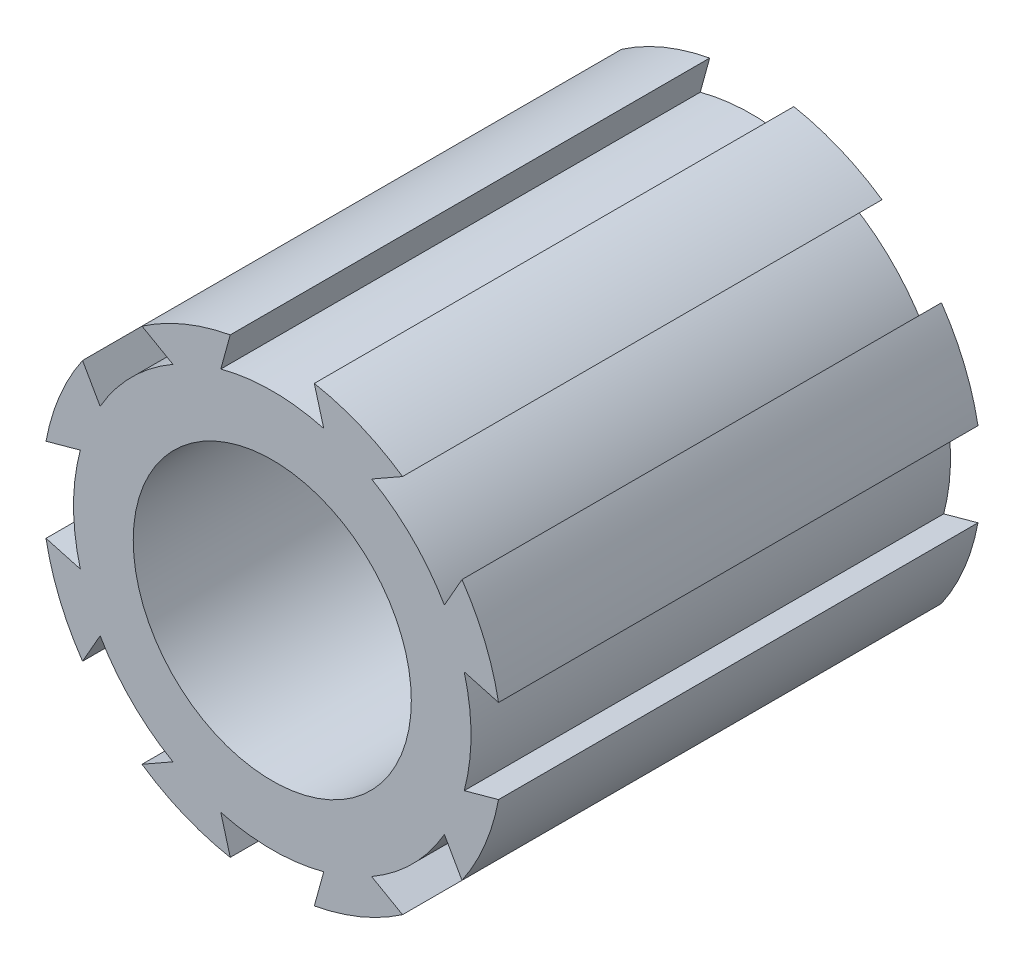
ISO-10303-21;
HEADER;
FILE_DESCRIPTION(('STEP AP214'),'2;1');
FILE_NAME('part.step','',(''),(''),'','','');
FILE_SCHEMA(('AUTOMOTIVE_DESIGN { 1 0 10303 214 1 1 1 1 }'));
ENDSEC;
DATA;
#1=APPLICATION_CONTEXT('core data for automotive mechanical design processes');
#2=APPLICATION_PROTOCOL_DEFINITION('international standard','automotive_design',2000,#1);
#3=PRODUCT_CONTEXT('',#1,'mechanical');
#4=PRODUCT('Part','Part','',(#3));
#5=PRODUCT_RELATED_PRODUCT_CATEGORY('part','',(#4));
#6=PRODUCT_DEFINITION_FORMATION('','',#4);
#7=PRODUCT_DEFINITION_CONTEXT('part definition',#1,'design');
#8=PRODUCT_DEFINITION('design','',#6,#7);
#9=PRODUCT_DEFINITION_SHAPE('','',#8);
#10=(LENGTH_UNIT() NAMED_UNIT(*) SI_UNIT(.MILLI.,.METRE.));
#11=(NAMED_UNIT(*) PLANE_ANGLE_UNIT() SI_UNIT($,.RADIAN.));
#12=(NAMED_UNIT(*) SI_UNIT($,.STERADIAN.) SOLID_ANGLE_UNIT());
#13=UNCERTAINTY_MEASURE_WITH_UNIT(LENGTH_MEASURE(1.E-05),#10,'distance_accuracy_value','');
#14=(GEOMETRIC_REPRESENTATION_CONTEXT(3) GLOBAL_UNCERTAINTY_ASSIGNED_CONTEXT((#13)) GLOBAL_UNIT_ASSIGNED_CONTEXT((#10,
#11,#12)) REPRESENTATION_CONTEXT('',''));
#15=CARTESIAN_POINT('',(0.,0.,0.));
#16=DIRECTION('',(0.,0.,1.));
#17=DIRECTION('',(1.,0.,0.));
#18=AXIS2_PLACEMENT_3D('',#15,#16,#17);
#19=CARTESIAN_POINT('',(0.,0.,50.));
#20=DIRECTION('',(0.,0.,1.));
#21=DIRECTION('',(1.,0.,0.));
#22=AXIS2_PLACEMENT_3D('',#19,#20,#21);
#23=PLANE('',#22);
#24=CARTESIAN_POINT('',(0.,0.,50.));
#25=DIRECTION('',(0.,0.,1.));
#26=DIRECTION('',(1.,0.,0.));
#27=AXIS2_PLACEMENT_3D('',#24,#25,#26);
#28=CIRCLE('',#27,14.5);
#29=CARTESIAN_POINT('',(14.5,0.,50.));
#30=VERTEX_POINT('',#29);
#31=EDGE_CURVE('E400',#30,#30,#28,.T.);
#32=ORIENTED_EDGE('',*,*,#31,.F.);
#33=EDGE_LOOP('',(#32));
#34=FACE_BOUND('',#33,.T.);
#35=DIRECTION('',(0.964233373796851,-0.265054712948747,0.));
#36=VECTOR('',#35,1.);
#37=CARTESIAN_POINT('',(-23.5961797931999,-4.38409616306333,50.));
#38=LINE('',#37,#36);
#39=CARTESIAN_POINT('',(-23.5961797931999,-4.38409616306334,50.));
#40=VERTEX_POINT('',#39);
#41=CARTESIAN_POINT('',(-20.017709679279,-5.36776919763804,50.));
#42=VERTEX_POINT('',#41);
#43=EDGE_CURVE('E260',#40,#42,#38,.T.);
#44=ORIENTED_EDGE('',*,*,#43,.F.);
#45=CARTESIAN_POINT('',(0.,0.,50.));
#46=DIRECTION('',(0.,0.,1.));
#47=DIRECTION('',(1.,0.,0.));
#48=AXIS2_PLACEMENT_3D('',#45,#46,#47);
#49=CIRCLE('',#48,24.);
#50=CARTESIAN_POINT('',(-19.7850428681449,-13.5849946155922,50.));
#51=VERTEX_POINT('',#50);
#52=EDGE_CURVE('E537',#40,#51,#49,.T.);
#53=ORIENTED_EDGE('',*,*,#52,.T.);
#54=DIRECTION('',(0.49439397234664,0.86923794216964,0.));
#55=VECTOR('',#54,1.);
#56=CARTESIAN_POINT('',(-19.7850428681449,-13.5849946155922,50.));
#57=LINE('',#56,#55);
#58=CARTESIAN_POINT('',(-17.9502442575361,-10.3590722585473,50.));
#59=VERTEX_POINT('',#58);
#60=EDGE_CURVE('E351',#51,#59,#57,.T.);
#61=ORIENTED_EDGE('',*,*,#60,.T.);
#62=CARTESIAN_POINT('',(0.,0.,50.));
#63=DIRECTION('',(0.,0.,-1.));
#64=DIRECTION('',(-1.,0.,0.));
#65=AXIS2_PLACEMENT_3D('',#62,#63,#64);
#66=CIRCLE('',#65,20.724904027836);
#67=CARTESIAN_POINT('',(-10.3590722585476,-17.9502442575359,50.));
#68=VERTEX_POINT('',#67);
#69=EDGE_CURVE('E356',#68,#59,#66,.T.);
#70=ORIENTED_EDGE('',*,*,#69,.F.);
#71=DIRECTION('',(0.869237942169648,0.494393972346625,0.));
#72=VECTOR('',#71,1.);
#73=CARTESIAN_POINT('',(-13.5849946155926,-19.7850428681446,50.));
#74=LINE('',#73,#72);
#75=CARTESIAN_POINT('',(-13.5849946155926,-19.7850428681446,50.));
#76=VERTEX_POINT('',#75);
#77=EDGE_CURVE('E341',#76,#68,#74,.T.);
#78=ORIENTED_EDGE('',*,*,#77,.F.);
#79=CARTESIAN_POINT('',(-4.38409616306375,-23.5961797931998,50.));
#80=VERTEX_POINT('',#79);
#81=EDGE_CURVE('E533',#76,#80,#49,.T.);
#82=ORIENTED_EDGE('',*,*,#81,.T.);
#83=DIRECTION('',(-0.26505471294873,0.964233373796855,0.));
#84=VECTOR('',#83,1.);
#85=CARTESIAN_POINT('',(-4.38409616306375,-23.5961797931998,50.));
#86=LINE('',#85,#84);
#87=CARTESIAN_POINT('',(-5.36776919763839,-20.0177096792789,50.));
#88=VERTEX_POINT('',#87);
#89=EDGE_CURVE('E338',#80,#88,#86,.T.);
#90=ORIENTED_EDGE('',*,*,#89,.T.);
#91=CARTESIAN_POINT('',(0.,0.,50.));
#92=DIRECTION('',(0.,0.,-1.));
#93=DIRECTION('',(-1.,0.,0.));
#94=AXIS2_PLACEMENT_3D('',#91,#92,#93);
#95=CIRCLE('',#94,20.724904027836);
#96=CARTESIAN_POINT('',(5.36776919763811,-20.017709679279,50.));
#97=VERTEX_POINT('',#96);
#98=EDGE_CURVE('E344',#97,#88,#95,.T.);
#99=ORIENTED_EDGE('',*,*,#98,.F.);
#100=DIRECTION('',(0.265054712948744,0.964233373796852,0.));
#101=VECTOR('',#100,1.);
#102=CARTESIAN_POINT('',(4.38409616306342,-23.5961797931999,50.));
#103=LINE('',#102,#101);
#104=CARTESIAN_POINT('',(4.38409616306342,-23.5961797931998,50.));
#105=VERTEX_POINT('',#104);
#106=EDGE_CURVE('E329',#105,#97,#103,.T.);
#107=ORIENTED_EDGE('',*,*,#106,.F.);
#108=CARTESIAN_POINT('',(13.5849946155923,-19.7850428681448,50.));
#109=VERTEX_POINT('',#108);
#110=EDGE_CURVE('E531',#105,#109,#49,.T.);
#111=ORIENTED_EDGE('',*,*,#110,.T.);
#112=DIRECTION('',(-0.869237942169641,0.494393972346637,0.));
#113=VECTOR('',#112,1.);
#114=CARTESIAN_POINT('',(13.5849946155923,-19.7850428681448,50.));
#115=LINE('',#114,#113);
#116=CARTESIAN_POINT('',(10.3590722585474,-17.9502442575361,50.));
#117=VERTEX_POINT('',#116);
#118=EDGE_CURVE('E61',#109,#117,#115,.T.);
#119=ORIENTED_EDGE('',*,*,#118,.T.);
#120=CARTESIAN_POINT('',(0.,0.,50.));
#121=DIRECTION('',(0.,0.,-1.));
#122=DIRECTION('',(-1.,0.,0.));
#123=AXIS2_PLACEMENT_3D('',#120,#121,#122);
#124=CIRCLE('',#123,20.724904027836);
#125=CARTESIAN_POINT('',(17.950244257536,-10.3590722585476,50.));
#126=VERTEX_POINT('',#125);
#127=EDGE_CURVE('E331',#126,#117,#124,.T.);
#128=ORIENTED_EDGE('',*,*,#127,.F.);
#129=DIRECTION('',(-0.494393972346629,0.869237942169646,0.));
#130=VECTOR('',#129,1.);
#131=CARTESIAN_POINT('',(19.7850428681447,-13.5849946155925,50.));
#132=LINE('',#131,#130);
#133=CARTESIAN_POINT('',(19.7850428681447,-13.5849946155925,50.));
#134=VERTEX_POINT('',#133);
#135=EDGE_CURVE('E318',#134,#126,#132,.T.);
#136=ORIENTED_EDGE('',*,*,#135,.F.);
#137=CARTESIAN_POINT('',(23.5961797931998,-4.38409616306366,50.));
#138=VERTEX_POINT('',#137);
#139=EDGE_CURVE('E411',#134,#138,#49,.T.);
#140=ORIENTED_EDGE('',*,*,#139,.T.);
#141=DIRECTION('',(-0.964233373796854,-0.265054712948734,0.));
#142=VECTOR('',#141,1.);
#143=CARTESIAN_POINT('',(23.5961797931998,-4.38409616306366,50.));
#144=LINE('',#143,#142);
#145=CARTESIAN_POINT('',(20.0177096792789,-5.36776919763832,50.));
#146=VERTEX_POINT('',#145);
#147=EDGE_CURVE('E53',#138,#146,#144,.T.);
#148=ORIENTED_EDGE('',*,*,#147,.T.);
#149=CARTESIAN_POINT('',(0.,0.,50.));
#150=DIRECTION('',(0.,0.,-1.));
#151=DIRECTION('',(-1.,0.,0.));
#152=AXIS2_PLACEMENT_3D('',#149,#150,#151);
#153=CIRCLE('',#152,20.724904027836);
#154=CARTESIAN_POINT('',(20.017709679279,5.36776919763818,50.));
#155=VERTEX_POINT('',#154);
#156=EDGE_CURVE('E320',#155,#146,#153,.T.);
#157=ORIENTED_EDGE('',*,*,#156,.F.);
#158=DIRECTION('',(-0.964233373796853,0.26505471294874,0.));
#159=VECTOR('',#158,1.);
#160=CARTESIAN_POINT('',(23.5961797931998,4.3840961630635,50.));
#161=LINE('',#160,#159);
#162=CARTESIAN_POINT('',(23.5961797931998,4.3840961630635,50.));
#163=VERTEX_POINT('',#162);
#164=EDGE_CURVE('E306',#163,#155,#161,.T.);
#165=ORIENTED_EDGE('',*,*,#164,.F.);
#166=CARTESIAN_POINT('',(19.7850428681448,13.5849946155924,50.));
#167=VERTEX_POINT('',#166);
#168=EDGE_CURVE('E406',#163,#167,#49,.T.);
#169=ORIENTED_EDGE('',*,*,#168,.T.);
#170=DIRECTION('',(-0.494393972346633,-0.869237942169643,0.));
#171=VECTOR('',#170,1.);
#172=CARTESIAN_POINT('',(19.7850428681448,13.5849946155923,50.));
#173=LINE('',#172,#171);
#174=CARTESIAN_POINT('',(17.950244257536,10.3590722585474,50.));
#175=VERTEX_POINT('',#174);
#176=EDGE_CURVE('E303',#167,#175,#173,.T.);
#177=ORIENTED_EDGE('',*,*,#176,.T.);
#178=CARTESIAN_POINT('',(0.,0.,50.));
#179=DIRECTION('',(0.,0.,-1.));
#180=DIRECTION('',(-1.,0.,0.));
#181=AXIS2_PLACEMENT_3D('',#178,#179,#180);
#182=CIRCLE('',#181,20.724904027836);
#183=CARTESIAN_POINT('',(10.3590722585475,17.950244257536,50.));
#184=VERTEX_POINT('',#183);
#185=EDGE_CURVE('E309',#184,#175,#182,.T.);
#186=ORIENTED_EDGE('',*,*,#185,.F.);
#187=DIRECTION('',(-0.869237942169645,-0.49439397234663,0.));
#188=VECTOR('',#187,1.);
#189=CARTESIAN_POINT('',(13.5849946155924,19.7850428681447,50.));
#190=LINE('',#189,#188);
#191=CARTESIAN_POINT('',(13.5849946155924,19.7850428681447,50.));
#192=VERTEX_POINT('',#191);
#193=EDGE_CURVE('E293',#192,#184,#190,.T.);
#194=ORIENTED_EDGE('',*,*,#193,.F.);
#195=CARTESIAN_POINT('',(4.38409616306358,23.5961797931998,50.));
#196=VERTEX_POINT('',#195);
#197=EDGE_CURVE('E410',#192,#196,#49,.T.);
#198=ORIENTED_EDGE('',*,*,#197,.T.);
#199=DIRECTION('',(0.265054712948737,-0.964233373796853,0.));
#200=VECTOR('',#199,1.);
#201=CARTESIAN_POINT('',(4.38409616306358,23.5961797931998,50.));
#202=LINE('',#201,#200);
#203=CARTESIAN_POINT('',(5.36776919763826,20.017709679279,50.));
#204=VERTEX_POINT('',#203);
#205=EDGE_CURVE('E290',#196,#204,#202,.T.);
#206=ORIENTED_EDGE('',*,*,#205,.T.);
#207=CARTESIAN_POINT('',(0.,0.,50.));
#208=DIRECTION('',(0.,0.,-1.));
#209=DIRECTION('',(-1.,0.,0.));
#210=AXIS2_PLACEMENT_3D('',#207,#208,#209);
#211=CIRCLE('',#210,20.724904027836);
#212=CARTESIAN_POINT('',(-5.36776919763825,20.017709679279,50.));
#213=VERTEX_POINT('',#212);
#214=EDGE_CURVE('E296',#213,#204,#211,.T.);
#215=ORIENTED_EDGE('',*,*,#214,.F.);
#216=DIRECTION('',(-0.265054712948737,-0.964233373796853,0.));
#217=VECTOR('',#216,1.);
#218=CARTESIAN_POINT('',(-4.38409616306358,23.5961797931998,50.));
#219=LINE('',#218,#217);
#220=CARTESIAN_POINT('',(-4.38409616306358,23.5961797931998,50.));
#221=VERTEX_POINT('',#220);
#222=EDGE_CURVE('E280',#221,#213,#219,.T.);
#223=ORIENTED_EDGE('',*,*,#222,.F.);
#224=CARTESIAN_POINT('',(-13.5849946155926,19.7850428681446,50.));
#225=VERTEX_POINT('',#224);
#226=EDGE_CURVE('E490',#221,#225,#49,.T.);
#227=ORIENTED_EDGE('',*,*,#226,.T.);
#228=DIRECTION('',(0.869237942169708,-0.494393972346519,0.));
#229=VECTOR('',#228,1.);
#230=CARTESIAN_POINT('',(-13.5849946155926,19.7850428681446,50.));
#231=LINE('',#230,#229);
#232=CARTESIAN_POINT('',(-10.3590722585472,17.9502442575362,50.));
#233=VERTEX_POINT('',#232);
#234=EDGE_CURVE('E277',#225,#233,#231,.T.);
#235=ORIENTED_EDGE('',*,*,#234,.T.);
#236=CARTESIAN_POINT('',(0.,0.,50.));
#237=DIRECTION('',(0.,0.,-1.));
#238=DIRECTION('',(-1.,0.,0.));
#239=AXIS2_PLACEMENT_3D('',#236,#237,#238);
#240=CIRCLE('',#239,20.724904027836);
#241=CARTESIAN_POINT('',(-17.9502442575359,10.3590722585477,50.));
#242=VERTEX_POINT('',#241);
#243=EDGE_CURVE('E283',#242,#233,#240,.T.);
#244=ORIENTED_EDGE('',*,*,#243,.F.);
#245=DIRECTION('',(0.494393972346623,-0.869237942169649,0.));
#246=VECTOR('',#245,1.);
#247=CARTESIAN_POINT('',(-19.7850428681446,13.5849946155926,50.));
#248=LINE('',#247,#246);
#249=CARTESIAN_POINT('',(-19.7850428681446,13.5849946155926,50.));
#250=VERTEX_POINT('',#249);
#251=EDGE_CURVE('E267',#250,#242,#248,.T.);
#252=ORIENTED_EDGE('',*,*,#251,.F.);
#253=CARTESIAN_POINT('',(-23.5961797931999,4.38409616306329,50.));
#254=VERTEX_POINT('',#253);
#255=EDGE_CURVE('E540',#250,#254,#49,.T.);
#256=ORIENTED_EDGE('',*,*,#255,.T.);
#257=DIRECTION('',(0.964233373796821,0.265054712948855,0.));
#258=VECTOR('',#257,1.);
#259=CARTESIAN_POINT('',(-23.5961797931999,4.38409616306329,50.));
#260=LINE('',#259,#258);
#261=CARTESIAN_POINT('',(-20.0177096792789,5.36776919763846,50.));
#262=VERTEX_POINT('',#261);
#263=EDGE_CURVE('E257',#254,#262,#260,.T.);
#264=ORIENTED_EDGE('',*,*,#263,.T.);
#265=CARTESIAN_POINT('',(0.,0.,50.));
#266=DIRECTION('',(0.,0.,-1.));
#267=DIRECTION('',(-1.,0.,0.));
#268=AXIS2_PLACEMENT_3D('',#265,#266,#267);
#269=CIRCLE('',#268,20.724904027836);
#270=EDGE_CURVE('E252',#42,#262,#269,.T.);
#271=ORIENTED_EDGE('',*,*,#270,.F.);
#272=EDGE_LOOP('',(#44,#53,#61,#70,#78,#82,#90,#99,#107,#111,#119,#128,#136,#140,#148,#157,#165,
#169,#177,#186,#194,#198,#206,#215,#223,#227,#235,#244,#252,#256,#264,#271));
#273=FACE_BOUND('',#272,.T.);
#274=ADVANCED_FACE('F38',(#34,#273),#23,.T.);
#275=CARTESIAN_POINT('',(0.,0.,0.));
#276=DIRECTION('',(0.,0.,1.));
#277=DIRECTION('',(1.,0.,0.));
#278=AXIS2_PLACEMENT_3D('',#275,#276,#277);
#279=PLANE('',#278);
#280=CARTESIAN_POINT('',(0.,0.,0.));
#281=DIRECTION('',(0.,0.,1.));
#282=DIRECTION('',(1.,0.,0.));
#283=AXIS2_PLACEMENT_3D('',#280,#281,#282);
#284=CIRCLE('',#283,14.5);
#285=CARTESIAN_POINT('',(14.5,0.,0.));
#286=VERTEX_POINT('',#285);
#287=EDGE_CURVE('E399',#286,#286,#284,.T.);
#288=ORIENTED_EDGE('',*,*,#287,.T.);
#289=EDGE_LOOP('',(#288));
#290=FACE_BOUND('',#289,.T.);
#291=CARTESIAN_POINT('',(0.,0.,0.));
#292=DIRECTION('',(0.,0.,1.));
#293=DIRECTION('',(1.,0.,0.));
#294=AXIS2_PLACEMENT_3D('',#291,#292,#293);
#295=CIRCLE('',#294,24.);
#296=CARTESIAN_POINT('',(-23.5961797931999,-4.38409616306334,0.));
#297=VERTEX_POINT('',#296);
#298=CARTESIAN_POINT('',(-19.7850428681449,-13.5849946155922,0.));
#299=VERTEX_POINT('',#298);
#300=EDGE_CURVE('E500',#297,#299,#295,.T.);
#301=ORIENTED_EDGE('',*,*,#300,.F.);
#302=DIRECTION('',(0.964233373796851,-0.265054712948747,0.));
#303=VECTOR('',#302,1.);
#304=CARTESIAN_POINT('',(-2.77818965910486,-10.1066800821768,0.));
#305=LINE('',#304,#303);
#306=CARTESIAN_POINT('',(-20.017709679279,-5.36776919763804,0.));
#307=VERTEX_POINT('',#306);
#308=EDGE_CURVE('E397',#297,#307,#305,.T.);
#309=ORIENTED_EDGE('',*,*,#308,.T.);
#310=CARTESIAN_POINT('',(0.,0.,0.));
#311=DIRECTION('',(0.,0.,1.));
#312=DIRECTION('',(1.,0.,0.));
#313=AXIS2_PLACEMENT_3D('',#310,#311,#312);
#314=CIRCLE('',#313,20.724904027836);
#315=CARTESIAN_POINT('',(-20.0177096792789,5.36776919763846,0.));
#316=VERTEX_POINT('',#315);
#317=EDGE_CURVE('E12',#307,#316,#314,.F.);
#318=ORIENTED_EDGE('',*,*,#317,.T.);
#319=DIRECTION('',(0.964233373796821,0.265054712948855,0.));
#320=VECTOR('',#319,1.);
#321=CARTESIAN_POINT('',(-2.77818965910662,10.1066800821788,0.));
#322=LINE('',#321,#320);
#323=CARTESIAN_POINT('',(-23.5961797931999,4.38409616306329,0.));
#324=VERTEX_POINT('',#323);
#325=EDGE_CURVE('E395',#324,#316,#322,.T.);
#326=ORIENTED_EDGE('',*,*,#325,.F.);
#327=CARTESIAN_POINT('',(-19.7850428681446,13.5849946155926,0.));
#328=VERTEX_POINT('',#327);
#329=EDGE_CURVE('E497',#328,#324,#295,.T.);
#330=ORIENTED_EDGE('',*,*,#329,.F.);
#331=DIRECTION('',(0.494393972346623,-0.86923794216965,0.));
#332=VECTOR('',#331,1.);
#333=CARTESIAN_POINT('',(-9.11097876876562,-5.18202527401484,0.));
#334=LINE('',#333,#332);
#335=CARTESIAN_POINT('',(-17.9502442575359,10.3590722585477,0.));
#336=VERTEX_POINT('',#335);
#337=EDGE_CURVE('E392',#328,#336,#334,.T.);
#338=ORIENTED_EDGE('',*,*,#337,.T.);
#339=CARTESIAN_POINT('',(0.,0.,0.));
#340=DIRECTION('',(0.,0.,1.));
#341=DIRECTION('',(1.,0.,0.));
#342=AXIS2_PLACEMENT_3D('',#339,#340,#341);
#343=CIRCLE('',#342,20.724904027836);
#344=CARTESIAN_POINT('',(-10.3590722585472,17.9502442575362,0.));
#345=VERTEX_POINT('',#344);
#346=EDGE_CURVE('E46',#336,#345,#343,.F.);
#347=ORIENTED_EDGE('',*,*,#346,.T.);
#348=DIRECTION('',(0.869237942169709,-0.494393972346519,0.));
#349=VECTOR('',#348,1.);
#350=CARTESIAN_POINT('',(5.18202527401502,9.11097876876847,0.));
#351=LINE('',#350,#349);
#352=CARTESIAN_POINT('',(-13.5849946155926,19.7850428681446,0.));
#353=VERTEX_POINT('',#352);
#354=EDGE_CURVE('E390',#353,#345,#351,.T.);
#355=ORIENTED_EDGE('',*,*,#354,.F.);
#356=CARTESIAN_POINT('',(-4.38409616306358,23.5961797931998,0.));
#357=VERTEX_POINT('',#356);
#358=EDGE_CURVE('E496',#357,#353,#295,.T.);
#359=ORIENTED_EDGE('',*,*,#358,.F.);
#360=DIRECTION('',(-0.265054712948737,-0.964233373796854,0.));
#361=VECTOR('',#360,1.);
#362=CARTESIAN_POINT('',(-10.1066800821769,2.77818965910475,0.));
#363=LINE('',#362,#361);
#364=CARTESIAN_POINT('',(-5.36776919763825,20.017709679279,0.));
#365=VERTEX_POINT('',#364);
#366=EDGE_CURVE('E387',#357,#365,#363,.T.);
#367=ORIENTED_EDGE('',*,*,#366,.T.);
#368=CARTESIAN_POINT('',(0.,0.,0.));
#369=DIRECTION('',(0.,0.,1.));
#370=DIRECTION('',(1.,0.,0.));
#371=AXIS2_PLACEMENT_3D('',#368,#369,#370);
#372=CIRCLE('',#371,20.724904027836);
#373=CARTESIAN_POINT('',(5.36776919763826,20.017709679279,0.));
#374=VERTEX_POINT('',#373);
#375=EDGE_CURVE('E468',#365,#374,#372,.F.);
#376=ORIENTED_EDGE('',*,*,#375,.T.);
#377=DIRECTION('',(0.265054712948737,-0.964233373796854,0.));
#378=VECTOR('',#377,1.);
#379=CARTESIAN_POINT('',(10.1066800821768,2.77818965910475,0.));
#380=LINE('',#379,#378);
#381=CARTESIAN_POINT('',(4.38409616306358,23.5961797931998,0.));
#382=VERTEX_POINT('',#381);
#383=EDGE_CURVE('E385',#382,#374,#380,.T.);
#384=ORIENTED_EDGE('',*,*,#383,.F.);
#385=CARTESIAN_POINT('',(13.5849946155924,19.7850428681447,0.));
#386=VERTEX_POINT('',#385);
#387=EDGE_CURVE('E415',#386,#382,#295,.T.);
#388=ORIENTED_EDGE('',*,*,#387,.F.);
#389=DIRECTION('',(-0.869237942169645,-0.49439397234663,0.));
#390=VECTOR('',#389,1.);
#391=CARTESIAN_POINT('',(-5.18202527401494,9.1109787687656,0.));
#392=LINE('',#391,#390);
#393=CARTESIAN_POINT('',(10.3590722585475,17.950244257536,0.));
#394=VERTEX_POINT('',#393);
#395=EDGE_CURVE('E382',#386,#394,#392,.T.);
#396=ORIENTED_EDGE('',*,*,#395,.T.);
#397=CARTESIAN_POINT('',(0.,0.,0.));
#398=DIRECTION('',(0.,0.,1.));
#399=DIRECTION('',(1.,0.,0.));
#400=AXIS2_PLACEMENT_3D('',#397,#398,#399);
#401=CIRCLE('',#400,20.724904027836);
#402=CARTESIAN_POINT('',(17.950244257536,10.3590722585474,0.));
#403=VERTEX_POINT('',#402);
#404=EDGE_CURVE('E465',#394,#403,#401,.F.);
#405=ORIENTED_EDGE('',*,*,#404,.T.);
#406=DIRECTION('',(-0.494393972346633,-0.869237942169644,0.));
#407=VECTOR('',#406,1.);
#408=CARTESIAN_POINT('',(9.11097876876558,-5.18202527401497,0.));
#409=LINE('',#408,#407);
#410=CARTESIAN_POINT('',(19.7850428681448,13.5849946155923,0.));
#411=VERTEX_POINT('',#410);
#412=EDGE_CURVE('E380',#411,#403,#409,.T.);
#413=ORIENTED_EDGE('',*,*,#412,.F.);
#414=CARTESIAN_POINT('',(23.5961797931998,4.3840961630635,0.));
#415=VERTEX_POINT('',#414);
#416=EDGE_CURVE('E412',#415,#411,#295,.T.);
#417=ORIENTED_EDGE('',*,*,#416,.F.);
#418=DIRECTION('',(-0.964233373796853,0.26505471294874,0.));
#419=VECTOR('',#418,1.);
#420=CARTESIAN_POINT('',(2.77818965910478,10.1066800821768,0.));
#421=LINE('',#420,#419);
#422=CARTESIAN_POINT('',(20.017709679279,5.36776919763818,0.));
#423=VERTEX_POINT('',#422);
#424=EDGE_CURVE('E377',#415,#423,#421,.T.);
#425=ORIENTED_EDGE('',*,*,#424,.T.);
#426=CARTESIAN_POINT('',(0.,0.,0.));
#427=DIRECTION('',(0.,0.,1.));
#428=DIRECTION('',(1.,0.,0.));
#429=AXIS2_PLACEMENT_3D('',#426,#427,#428);
#430=CIRCLE('',#429,20.724904027836);
#431=CARTESIAN_POINT('',(20.0177096792789,-5.36776919763832,0.));
#432=VERTEX_POINT('',#431);
#433=EDGE_CURVE('E462',#423,#432,#430,.F.);
#434=ORIENTED_EDGE('',*,*,#433,.T.);
#435=DIRECTION('',(-0.964233373796854,-0.265054712948734,0.));
#436=VECTOR('',#435,1.);
#437=CARTESIAN_POINT('',(2.77818965910472,-10.1066800821769,0.));
#438=LINE('',#437,#436);
#439=CARTESIAN_POINT('',(23.5961797931998,-4.38409616306366,0.));
#440=VERTEX_POINT('',#439);
#441=EDGE_CURVE('E375',#440,#432,#438,.T.);
#442=ORIENTED_EDGE('',*,*,#441,.F.);
#443=CARTESIAN_POINT('',(19.7850428681447,-13.5849946155925,0.));
#444=VERTEX_POINT('',#443);
#445=EDGE_CURVE('E403',#444,#440,#295,.T.);
#446=ORIENTED_EDGE('',*,*,#445,.F.);
#447=DIRECTION('',(-0.494393972346629,0.869237942169646,0.));
#448=VECTOR('',#447,1.);
#449=CARTESIAN_POINT('',(9.11097876876558,5.18202527401491,0.));
#450=LINE('',#449,#448);
#451=CARTESIAN_POINT('',(17.950244257536,-10.3590722585476,0.));
#452=VERTEX_POINT('',#451);
#453=EDGE_CURVE('E372',#444,#452,#450,.T.);
#454=ORIENTED_EDGE('',*,*,#453,.T.);
#455=CARTESIAN_POINT('',(0.,0.,0.));
#456=DIRECTION('',(0.,0.,1.));
#457=DIRECTION('',(1.,0.,0.));
#458=AXIS2_PLACEMENT_3D('',#455,#456,#457);
#459=CIRCLE('',#458,20.724904027836);
#460=CARTESIAN_POINT('',(10.3590722585474,-17.9502442575361,0.));
#461=VERTEX_POINT('',#460);
#462=EDGE_CURVE('E459',#452,#461,#459,.F.);
#463=ORIENTED_EDGE('',*,*,#462,.T.);
#464=DIRECTION('',(-0.869237942169641,0.494393972346637,0.));
#465=VECTOR('',#464,1.);
#466=CARTESIAN_POINT('',(-5.182025274015,-9.11097876876555,0.));
#467=LINE('',#466,#465);
#468=CARTESIAN_POINT('',(13.5849946155923,-19.7850428681448,0.));
#469=VERTEX_POINT('',#468);
#470=EDGE_CURVE('E370',#469,#461,#467,.T.);
#471=ORIENTED_EDGE('',*,*,#470,.F.);
#472=CARTESIAN_POINT('',(4.38409616306342,-23.5961797931998,0.));
#473=VERTEX_POINT('',#472);
#474=EDGE_CURVE('E508',#473,#469,#295,.T.);
#475=ORIENTED_EDGE('',*,*,#474,.F.);
#476=DIRECTION('',(0.265054712948744,0.964233373796852,0.));
#477=VECTOR('',#476,1.);
#478=CARTESIAN_POINT('',(10.1066800821768,-2.77818965910482,0.));
#479=LINE('',#478,#477);
#480=CARTESIAN_POINT('',(5.36776919763811,-20.017709679279,0.));
#481=VERTEX_POINT('',#480);
#482=EDGE_CURVE('E367',#473,#481,#479,.T.);
#483=ORIENTED_EDGE('',*,*,#482,.T.);
#484=CARTESIAN_POINT('',(0.,0.,0.));
#485=DIRECTION('',(0.,0.,1.));
#486=DIRECTION('',(1.,0.,0.));
#487=AXIS2_PLACEMENT_3D('',#484,#485,#486);
#488=CIRCLE('',#487,20.724904027836);
#489=CARTESIAN_POINT('',(-5.36776919763839,-20.0177096792789,0.));
#490=VERTEX_POINT('',#489);
#491=EDGE_CURVE('E456',#481,#490,#488,.F.);
#492=ORIENTED_EDGE('',*,*,#491,.T.);
#493=DIRECTION('',(-0.26505471294873,0.964233373796855,0.));
#494=VECTOR('',#493,1.);
#495=CARTESIAN_POINT('',(-10.1066800821769,-2.77818965910468,0.));
#496=LINE('',#495,#494);
#497=CARTESIAN_POINT('',(-4.38409616306375,-23.5961797931998,0.));
#498=VERTEX_POINT('',#497);
#499=EDGE_CURVE('E365',#498,#490,#496,.T.);
#500=ORIENTED_EDGE('',*,*,#499,.F.);
#501=CARTESIAN_POINT('',(-13.5849946155926,-19.7850428681446,0.));
#502=VERTEX_POINT('',#501);
#503=EDGE_CURVE('E504',#502,#498,#295,.T.);
#504=ORIENTED_EDGE('',*,*,#503,.F.);
#505=DIRECTION('',(0.869237942169648,0.494393972346625,0.));
#506=VECTOR('',#505,1.);
#507=CARTESIAN_POINT('',(5.18202527401488,-9.11097876876562,0.));
#508=LINE('',#507,#506);
#509=CARTESIAN_POINT('',(-10.3590722585476,-17.9502442575359,0.));
#510=VERTEX_POINT('',#509);
#511=EDGE_CURVE('E362',#502,#510,#508,.T.);
#512=ORIENTED_EDGE('',*,*,#511,.T.);
#513=CARTESIAN_POINT('',(0.,0.,0.));
#514=DIRECTION('',(0.,0.,1.));
#515=DIRECTION('',(1.,0.,0.));
#516=AXIS2_PLACEMENT_3D('',#513,#514,#515);
#517=CIRCLE('',#516,20.724904027836);
#518=CARTESIAN_POINT('',(-17.9502442575361,-10.3590722585473,0.));
#519=VERTEX_POINT('',#518);
#520=EDGE_CURVE('E453',#510,#519,#517,.F.);
#521=ORIENTED_EDGE('',*,*,#520,.T.);
#522=DIRECTION('',(0.49439397234664,0.86923794216964,0.));
#523=VECTOR('',#522,1.);
#524=CARTESIAN_POINT('',(-9.11097876876553,5.18202527401503,0.));
#525=LINE('',#524,#523);
#526=EDGE_CURVE('E273',#299,#519,#525,.T.);
#527=ORIENTED_EDGE('',*,*,#526,.F.);
#528=EDGE_LOOP('',(#301,#309,#318,#326,#330,#338,#347,#355,#359,#367,#376,#384,#388,#396,#405,
#413,#417,#425,#434,#442,#446,#454,#463,#471,#475,#483,#492,#500,#504,#512,#521,#527));
#529=FACE_BOUND('',#528,.T.);
#530=ADVANCED_FACE('F474',(#290,#529),#279,.F.);
#531=CARTESIAN_POINT('',(0.,0.,50.));
#532=DIRECTION('',(0.,0.,-1.));
#533=DIRECTION('',(-1.,0.,0.));
#534=AXIS2_PLACEMENT_3D('',#531,#532,#533);
#535=CYLINDRICAL_SURFACE('',#534,24.);
#536=DIRECTION('',(0.,0.,-1.));
#537=VECTOR('',#536,1.);
#538=CARTESIAN_POINT('',(-23.5961797931999,4.38409616306329,50.));
#539=LINE('',#538,#537);
#540=EDGE_CURVE('E450',#254,#324,#539,.T.);
#541=ORIENTED_EDGE('',*,*,#540,.F.);
#542=ORIENTED_EDGE('',*,*,#255,.F.);
#543=DIRECTION('',(0.,0.,-1.));
#544=VECTOR('',#543,1.);
#545=CARTESIAN_POINT('',(-19.7850428681446,13.5849946155926,50.));
#546=LINE('',#545,#544);
#547=EDGE_CURVE('E447',#250,#328,#546,.T.);
#548=ORIENTED_EDGE('',*,*,#547,.T.);
#549=ORIENTED_EDGE('',*,*,#329,.T.);
#550=EDGE_LOOP('',(#541,#542,#548,#549));
#551=FACE_BOUND('',#550,.T.);
#552=ADVANCED_FACE('F575',(#551),#535,.T.);
#553=DIRECTION('',(0.,0.,-1.));
#554=VECTOR('',#553,1.);
#555=CARTESIAN_POINT('',(-13.5849946155926,19.7850428681446,50.));
#556=LINE('',#555,#554);
#557=EDGE_CURVE('E445',#225,#353,#556,.T.);
#558=ORIENTED_EDGE('',*,*,#557,.F.);
#559=ORIENTED_EDGE('',*,*,#226,.F.);
#560=DIRECTION('',(0.,0.,-1.));
#561=VECTOR('',#560,1.);
#562=CARTESIAN_POINT('',(-4.38409616306358,23.5961797931998,50.));
#563=LINE('',#562,#561);
#564=EDGE_CURVE('E442',#221,#357,#563,.T.);
#565=ORIENTED_EDGE('',*,*,#564,.T.);
#566=ORIENTED_EDGE('',*,*,#358,.T.);
#567=EDGE_LOOP('',(#558,#559,#565,#566));
#568=FACE_BOUND('',#567,.T.);
#569=ADVANCED_FACE('F495',(#568),#535,.T.);
#570=DIRECTION('',(0.,0.,-1.));
#571=VECTOR('',#570,1.);
#572=CARTESIAN_POINT('',(4.38409616306358,23.5961797931998,50.));
#573=LINE('',#572,#571);
#574=EDGE_CURVE('E440',#196,#382,#573,.T.);
#575=ORIENTED_EDGE('',*,*,#574,.F.);
#576=ORIENTED_EDGE('',*,*,#197,.F.);
#577=DIRECTION('',(0.,0.,-1.));
#578=VECTOR('',#577,1.);
#579=CARTESIAN_POINT('',(13.5849946155924,19.7850428681447,50.));
#580=LINE('',#579,#578);
#581=EDGE_CURVE('E437',#192,#386,#580,.T.);
#582=ORIENTED_EDGE('',*,*,#581,.T.);
#583=ORIENTED_EDGE('',*,*,#387,.T.);
#584=EDGE_LOOP('',(#575,#576,#582,#583));
#585=FACE_BOUND('',#584,.T.);
#586=ADVANCED_FACE('F548',(#585),#535,.T.);
#587=DIRECTION('',(0.,0.,-1.));
#588=VECTOR('',#587,1.);
#589=CARTESIAN_POINT('',(19.7850428681448,13.5849946155924,50.));
#590=LINE('',#589,#588);
#591=EDGE_CURVE('E435',#167,#411,#590,.T.);
#592=ORIENTED_EDGE('',*,*,#591,.F.);
#593=ORIENTED_EDGE('',*,*,#168,.F.);
#594=DIRECTION('',(0.,0.,-1.));
#595=VECTOR('',#594,1.);
#596=CARTESIAN_POINT('',(23.5961797931998,4.3840961630635,50.));
#597=LINE('',#596,#595);
#598=EDGE_CURVE('E432',#163,#415,#597,.T.);
#599=ORIENTED_EDGE('',*,*,#598,.T.);
#600=ORIENTED_EDGE('',*,*,#416,.T.);
#601=EDGE_LOOP('',(#592,#593,#599,#600));
#602=FACE_BOUND('',#601,.T.);
#603=ADVANCED_FACE('F645',(#602),#535,.T.);
#604=DIRECTION('',(0.,0.,-1.));
#605=VECTOR('',#604,1.);
#606=CARTESIAN_POINT('',(23.5961797931998,-4.38409616306366,50.));
#607=LINE('',#606,#605);
#608=EDGE_CURVE('E430',#138,#440,#607,.T.);
#609=ORIENTED_EDGE('',*,*,#608,.F.);
#610=ORIENTED_EDGE('',*,*,#139,.F.);
#611=DIRECTION('',(0.,0.,-1.));
#612=VECTOR('',#611,1.);
#613=CARTESIAN_POINT('',(19.7850428681447,-13.5849946155925,50.));
#614=LINE('',#613,#612);
#615=EDGE_CURVE('E427',#134,#444,#614,.T.);
#616=ORIENTED_EDGE('',*,*,#615,.T.);
#617=ORIENTED_EDGE('',*,*,#445,.T.);
#618=EDGE_LOOP('',(#609,#610,#616,#617));
#619=FACE_BOUND('',#618,.T.);
#620=ADVANCED_FACE('F518',(#619),#535,.T.);
#621=DIRECTION('',(0.,0.,-1.));
#622=VECTOR('',#621,1.);
#623=CARTESIAN_POINT('',(13.5849946155923,-19.7850428681448,50.));
#624=LINE('',#623,#622);
#625=EDGE_CURVE('E425',#109,#469,#624,.T.);
#626=ORIENTED_EDGE('',*,*,#625,.F.);
#627=ORIENTED_EDGE('',*,*,#110,.F.);
#628=DIRECTION('',(0.,0.,-1.));
#629=VECTOR('',#628,1.);
#630=CARTESIAN_POINT('',(4.38409616306342,-23.5961797931999,50.));
#631=LINE('',#630,#629);
#632=EDGE_CURVE('E422',#105,#473,#631,.T.);
#633=ORIENTED_EDGE('',*,*,#632,.T.);
#634=ORIENTED_EDGE('',*,*,#474,.T.);
#635=EDGE_LOOP('',(#626,#627,#633,#634));
#636=FACE_BOUND('',#635,.T.);
#637=ADVANCED_FACE('F651',(#636),#535,.T.);
#638=DIRECTION('',(0.,0.,-1.));
#639=VECTOR('',#638,1.);
#640=CARTESIAN_POINT('',(-4.38409616306375,-23.5961797931998,50.));
#641=LINE('',#640,#639);
#642=EDGE_CURVE('E420',#80,#498,#641,.T.);
#643=ORIENTED_EDGE('',*,*,#642,.F.);
#644=ORIENTED_EDGE('',*,*,#81,.F.);
#645=DIRECTION('',(0.,0.,-1.));
#646=VECTOR('',#645,1.);
#647=CARTESIAN_POINT('',(-13.5849946155926,-19.7850428681446,50.));
#648=LINE('',#647,#646);
#649=EDGE_CURVE('E417',#76,#502,#648,.T.);
#650=ORIENTED_EDGE('',*,*,#649,.T.);
#651=ORIENTED_EDGE('',*,*,#503,.T.);
#652=EDGE_LOOP('',(#643,#644,#650,#651));
#653=FACE_BOUND('',#652,.T.);
#654=ADVANCED_FACE('F661',(#653),#535,.T.);
#655=ORIENTED_EDGE('',*,*,#52,.F.);
#656=DIRECTION('',(0.,0.,-1.));
#657=VECTOR('',#656,1.);
#658=CARTESIAN_POINT('',(-23.5961797931999,-4.38409616306333,50.));
#659=LINE('',#658,#657);
#660=EDGE_CURVE('E263',#40,#297,#659,.T.);
#661=ORIENTED_EDGE('',*,*,#660,.T.);
#662=ORIENTED_EDGE('',*,*,#300,.T.);
#663=DIRECTION('',(0.,0.,-1.));
#664=VECTOR('',#663,1.);
#665=CARTESIAN_POINT('',(-19.7850428681449,-13.5849946155922,50.));
#666=LINE('',#665,#664);
#667=EDGE_CURVE('E409',#51,#299,#666,.T.);
#668=ORIENTED_EDGE('',*,*,#667,.F.);
#669=EDGE_LOOP('',(#655,#661,#662,#668));
#670=FACE_BOUND('',#669,.T.);
#671=ADVANCED_FACE('F40',(#670),#535,.T.);
#672=CARTESIAN_POINT('',(0.,0.,50.));
#673=DIRECTION('',(0.,0.,-1.));
#674=DIRECTION('',(-1.,0.,0.));
#675=AXIS2_PLACEMENT_3D('',#672,#673,#674);
#676=CYLINDRICAL_SURFACE('',#675,14.5);
#677=ORIENTED_EDGE('',*,*,#31,.T.);
#678=EDGE_LOOP('',(#677));
#679=FACE_BOUND('',#678,.T.);
#680=ORIENTED_EDGE('',*,*,#287,.F.);
#681=EDGE_LOOP('',(#680));
#682=FACE_BOUND('',#681,.T.);
#683=ADVANCED_FACE('F579',(#679,#682),#676,.F.);
#684=CARTESIAN_POINT('',(0.,0.,-16.));
#685=DIRECTION('',(0.,0.,1.));
#686=DIRECTION('',(1.,0.,0.));
#687=AXIS2_PLACEMENT_3D('',#684,#685,#686);
#688=CYLINDRICAL_SURFACE('',#687,20.724904027836);
#689=DIRECTION('',(0.,0.,1.));
#690=VECTOR('',#689,1.);
#691=CARTESIAN_POINT('',(-10.3590722585476,-17.9502442575359,-16.));
#692=LINE('',#691,#690);
#693=EDGE_CURVE('E349',#510,#68,#692,.T.);
#694=ORIENTED_EDGE('',*,*,#693,.T.);
#695=ORIENTED_EDGE('',*,*,#69,.T.);
#696=DIRECTION('',(0.,0.,1.));
#697=VECTOR('',#696,1.);
#698=CARTESIAN_POINT('',(-17.9502442575361,-10.3590722585473,-16.));
#699=LINE('',#698,#697);
#700=EDGE_CURVE('E352',#519,#59,#699,.T.);
#701=ORIENTED_EDGE('',*,*,#700,.F.);
#702=ORIENTED_EDGE('',*,*,#520,.F.);
#703=EDGE_LOOP('',(#694,#695,#701,#702));
#704=FACE_BOUND('',#703,.T.);
#705=ADVANCED_FACE('F582',(#704),#688,.T.);
#706=CARTESIAN_POINT('',(-13.5849946155926,-19.7850428681446,-16.));
#707=DIRECTION('',(0.494393972346625,-0.869237942169648,0.));
#708=DIRECTION('',(0.869237942169648,0.494393972346625,0.));
#709=AXIS2_PLACEMENT_3D('',#706,#707,#708);
#710=PLANE('',#709);
#711=ORIENTED_EDGE('',*,*,#649,.F.);
#712=ORIENTED_EDGE('',*,*,#77,.T.);
#713=ORIENTED_EDGE('',*,*,#693,.F.);
#714=ORIENTED_EDGE('',*,*,#511,.F.);
#715=EDGE_LOOP('',(#711,#712,#713,#714));
#716=FACE_BOUND('',#715,.T.);
#717=ADVANCED_FACE('F588',(#716),#710,.F.);
#718=CARTESIAN_POINT('',(-19.7850428681449,-13.5849946155922,-16.));
#719=DIRECTION('',(0.86923794216964,-0.49439397234664,0.));
#720=DIRECTION('',(0.49439397234664,0.86923794216964,0.));
#721=AXIS2_PLACEMENT_3D('',#718,#719,#720);
#722=PLANE('',#721);
#723=ORIENTED_EDGE('',*,*,#526,.T.);
#724=ORIENTED_EDGE('',*,*,#700,.T.);
#725=ORIENTED_EDGE('',*,*,#60,.F.);
#726=ORIENTED_EDGE('',*,*,#667,.T.);
#727=EDGE_LOOP('',(#723,#724,#725,#726));
#728=FACE_BOUND('',#727,.T.);
#729=ADVANCED_FACE('F584',(#728),#722,.T.);
#730=CARTESIAN_POINT('',(0.,0.,-16.));
#731=DIRECTION('',(0.,0.,1.));
#732=DIRECTION('',(1.,0.,0.));
#733=AXIS2_PLACEMENT_3D('',#730,#731,#732);
#734=CYLINDRICAL_SURFACE('',#733,20.724904027836);
#735=DIRECTION('',(0.,0.,1.));
#736=VECTOR('',#735,1.);
#737=CARTESIAN_POINT('',(5.36776919763811,-20.017709679279,-16.));
#738=LINE('',#737,#736);
#739=EDGE_CURVE('E336',#481,#97,#738,.T.);
#740=ORIENTED_EDGE('',*,*,#739,.T.);
#741=ORIENTED_EDGE('',*,*,#98,.T.);
#742=DIRECTION('',(0.,0.,1.));
#743=VECTOR('',#742,1.);
#744=CARTESIAN_POINT('',(-5.36776919763839,-20.0177096792789,-16.));
#745=LINE('',#744,#743);
#746=EDGE_CURVE('E339',#490,#88,#745,.T.);
#747=ORIENTED_EDGE('',*,*,#746,.F.);
#748=ORIENTED_EDGE('',*,*,#491,.F.);
#749=EDGE_LOOP('',(#740,#741,#747,#748));
#750=FACE_BOUND('',#749,.T.);
#751=ADVANCED_FACE('F587',(#750),#734,.T.);
#752=CARTESIAN_POINT('',(4.38409616306342,-23.5961797931999,-16.));
#753=DIRECTION('',(0.964233373796852,-0.265054712948744,0.));
#754=DIRECTION('',(0.265054712948744,0.964233373796852,0.));
#755=AXIS2_PLACEMENT_3D('',#752,#753,#754);
#756=PLANE('',#755);
#757=ORIENTED_EDGE('',*,*,#632,.F.);
#758=ORIENTED_EDGE('',*,*,#106,.T.);
#759=ORIENTED_EDGE('',*,*,#739,.F.);
#760=ORIENTED_EDGE('',*,*,#482,.F.);
#761=EDGE_LOOP('',(#757,#758,#759,#760));
#762=FACE_BOUND('',#761,.T.);
#763=ADVANCED_FACE('F600',(#762),#756,.F.);
#764=CARTESIAN_POINT('',(-4.38409616306375,-23.5961797931998,-16.));
#765=DIRECTION('',(0.964233373796855,0.26505471294873,0.));
#766=DIRECTION('',(-0.26505471294873,0.964233373796855,0.));
#767=AXIS2_PLACEMENT_3D('',#764,#765,#766);
#768=PLANE('',#767);
#769=ORIENTED_EDGE('',*,*,#499,.T.);
#770=ORIENTED_EDGE('',*,*,#746,.T.);
#771=ORIENTED_EDGE('',*,*,#89,.F.);
#772=ORIENTED_EDGE('',*,*,#642,.T.);
#773=EDGE_LOOP('',(#769,#770,#771,#772));
#774=FACE_BOUND('',#773,.T.);
#775=ADVANCED_FACE('F596',(#774),#768,.T.);
#776=CARTESIAN_POINT('',(0.,0.,-16.));
#777=DIRECTION('',(0.,0.,1.));
#778=DIRECTION('',(1.,0.,0.));
#779=AXIS2_PLACEMENT_3D('',#776,#777,#778);
#780=CYLINDRICAL_SURFACE('',#779,20.724904027836);
#781=DIRECTION('',(0.,0.,1.));
#782=VECTOR('',#781,1.);
#783=CARTESIAN_POINT('',(17.950244257536,-10.3590722585476,-16.));
#784=LINE('',#783,#782);
#785=EDGE_CURVE('E325',#452,#126,#784,.T.);
#786=ORIENTED_EDGE('',*,*,#785,.T.);
#787=ORIENTED_EDGE('',*,*,#127,.T.);
#788=DIRECTION('',(0.,0.,1.));
#789=VECTOR('',#788,1.);
#790=CARTESIAN_POINT('',(10.3590722585474,-17.9502442575361,-16.));
#791=LINE('',#790,#789);
#792=EDGE_CURVE('E327',#461,#117,#791,.T.);
#793=ORIENTED_EDGE('',*,*,#792,.F.);
#794=ORIENTED_EDGE('',*,*,#462,.F.);
#795=EDGE_LOOP('',(#786,#787,#793,#794));
#796=FACE_BOUND('',#795,.T.);
#797=ADVANCED_FACE('F599',(#796),#780,.T.);
#798=CARTESIAN_POINT('',(19.7850428681447,-13.5849946155925,-16.));
#799=DIRECTION('',(0.869237942169646,0.494393972346629,0.));
#800=DIRECTION('',(-0.494393972346629,0.869237942169646,0.));
#801=AXIS2_PLACEMENT_3D('',#798,#799,#800);
#802=PLANE('',#801);
#803=ORIENTED_EDGE('',*,*,#615,.F.);
#804=ORIENTED_EDGE('',*,*,#135,.T.);
#805=ORIENTED_EDGE('',*,*,#785,.F.);
#806=ORIENTED_EDGE('',*,*,#453,.F.);
#807=EDGE_LOOP('',(#803,#804,#805,#806));
#808=FACE_BOUND('',#807,.T.);
#809=ADVANCED_FACE('F611',(#808),#802,.F.);
#810=CARTESIAN_POINT('',(13.5849946155923,-19.7850428681448,-16.));
#811=DIRECTION('',(0.494393972346637,0.869237942169641,0.));
#812=DIRECTION('',(-0.869237942169641,0.494393972346637,0.));
#813=AXIS2_PLACEMENT_3D('',#810,#811,#812);
#814=PLANE('',#813);
#815=ORIENTED_EDGE('',*,*,#470,.T.);
#816=ORIENTED_EDGE('',*,*,#792,.T.);
#817=ORIENTED_EDGE('',*,*,#118,.F.);
#818=ORIENTED_EDGE('',*,*,#625,.T.);
#819=EDGE_LOOP('',(#815,#816,#817,#818));
#820=FACE_BOUND('',#819,.T.);
#821=ADVANCED_FACE('F608',(#820),#814,.T.);
#822=CARTESIAN_POINT('',(0.,0.,-16.));
#823=DIRECTION('',(0.,0.,1.));
#824=DIRECTION('',(1.,0.,0.));
#825=AXIS2_PLACEMENT_3D('',#822,#823,#824);
#826=CYLINDRICAL_SURFACE('',#825,20.724904027836);
#827=DIRECTION('',(0.,0.,1.));
#828=VECTOR('',#827,1.);
#829=CARTESIAN_POINT('',(20.017709679279,5.36776919763818,-16.));
#830=LINE('',#829,#828);
#831=EDGE_CURVE('E314',#423,#155,#830,.T.);
#832=ORIENTED_EDGE('',*,*,#831,.T.);
#833=ORIENTED_EDGE('',*,*,#156,.T.);
#834=DIRECTION('',(0.,0.,1.));
#835=VECTOR('',#834,1.);
#836=CARTESIAN_POINT('',(20.0177096792789,-5.36776919763832,-16.));
#837=LINE('',#836,#835);
#838=EDGE_CURVE('E316',#432,#146,#837,.T.);
#839=ORIENTED_EDGE('',*,*,#838,.F.);
#840=ORIENTED_EDGE('',*,*,#433,.F.);
#841=EDGE_LOOP('',(#832,#833,#839,#840));
#842=FACE_BOUND('',#841,.T.);
#843=ADVANCED_FACE('F525',(#842),#826,.T.);
#844=CARTESIAN_POINT('',(23.5961797931998,4.3840961630635,-16.));
#845=DIRECTION('',(0.26505471294874,0.964233373796853,0.));
#846=DIRECTION('',(-0.964233373796853,0.26505471294874,0.));
#847=AXIS2_PLACEMENT_3D('',#844,#845,#846);
#848=PLANE('',#847);
#849=ORIENTED_EDGE('',*,*,#598,.F.);
#850=ORIENTED_EDGE('',*,*,#164,.T.);
#851=ORIENTED_EDGE('',*,*,#831,.F.);
#852=ORIENTED_EDGE('',*,*,#424,.F.);
#853=EDGE_LOOP('',(#849,#850,#851,#852));
#854=FACE_BOUND('',#853,.T.);
#855=ADVANCED_FACE('F621',(#854),#848,.F.);
#856=CARTESIAN_POINT('',(23.5961797931998,-4.38409616306366,-16.));
#857=DIRECTION('',(-0.265054712948734,0.964233373796854,0.));
#858=DIRECTION('',(-0.964233373796854,-0.265054712948734,0.));
#859=AXIS2_PLACEMENT_3D('',#856,#857,#858);
#860=PLANE('',#859);
#861=ORIENTED_EDGE('',*,*,#441,.T.);
#862=ORIENTED_EDGE('',*,*,#838,.T.);
#863=ORIENTED_EDGE('',*,*,#147,.F.);
#864=ORIENTED_EDGE('',*,*,#608,.T.);
#865=EDGE_LOOP('',(#861,#862,#863,#864));
#866=FACE_BOUND('',#865,.T.);
#867=ADVANCED_FACE('F523',(#866),#860,.T.);
#868=CARTESIAN_POINT('',(0.,0.,-16.));
#869=DIRECTION('',(0.,0.,1.));
#870=DIRECTION('',(1.,0.,0.));
#871=AXIS2_PLACEMENT_3D('',#868,#869,#870);
#872=CYLINDRICAL_SURFACE('',#871,20.724904027836);
#873=DIRECTION('',(0.,0.,1.));
#874=VECTOR('',#873,1.);
#875=CARTESIAN_POINT('',(10.3590722585475,17.950244257536,-16.));
#876=LINE('',#875,#874);
#877=EDGE_CURVE('E301',#394,#184,#876,.T.);
#878=ORIENTED_EDGE('',*,*,#877,.T.);
#879=ORIENTED_EDGE('',*,*,#185,.T.);
#880=DIRECTION('',(0.,0.,1.));
#881=VECTOR('',#880,1.);
#882=CARTESIAN_POINT('',(17.950244257536,10.3590722585474,-16.));
#883=LINE('',#882,#881);
#884=EDGE_CURVE('E304',#403,#175,#883,.T.);
#885=ORIENTED_EDGE('',*,*,#884,.F.);
#886=ORIENTED_EDGE('',*,*,#404,.F.);
#887=EDGE_LOOP('',(#878,#879,#885,#886));
#888=FACE_BOUND('',#887,.T.);
#889=ADVANCED_FACE('F620',(#888),#872,.T.);
#890=CARTESIAN_POINT('',(13.5849946155924,19.7850428681447,-16.));
#891=DIRECTION('',(-0.49439397234663,0.869237942169645,0.));
#892=DIRECTION('',(-0.869237942169645,-0.49439397234663,0.));
#893=AXIS2_PLACEMENT_3D('',#890,#891,#892);
#894=PLANE('',#893);
#895=ORIENTED_EDGE('',*,*,#581,.F.);
#896=ORIENTED_EDGE('',*,*,#193,.T.);
#897=ORIENTED_EDGE('',*,*,#877,.F.);
#898=ORIENTED_EDGE('',*,*,#395,.F.);
#899=EDGE_LOOP('',(#895,#896,#897,#898));
#900=FACE_BOUND('',#899,.T.);
#901=ADVANCED_FACE('F629',(#900),#894,.F.);
#902=CARTESIAN_POINT('',(19.7850428681448,13.5849946155923,-16.));
#903=DIRECTION('',(-0.869237942169644,0.494393972346633,0.));
#904=DIRECTION('',(-0.494393972346633,-0.869237942169644,0.));
#905=AXIS2_PLACEMENT_3D('',#902,#903,#904);
#906=PLANE('',#905);
#907=ORIENTED_EDGE('',*,*,#412,.T.);
#908=ORIENTED_EDGE('',*,*,#884,.T.);
#909=ORIENTED_EDGE('',*,*,#176,.F.);
#910=ORIENTED_EDGE('',*,*,#591,.T.);
#911=EDGE_LOOP('',(#907,#908,#909,#910));
#912=FACE_BOUND('',#911,.T.);
#913=ADVANCED_FACE('F566',(#912),#906,.T.);
#914=CARTESIAN_POINT('',(0.,0.,-16.));
#915=DIRECTION('',(0.,0.,1.));
#916=DIRECTION('',(1.,0.,0.));
#917=AXIS2_PLACEMENT_3D('',#914,#915,#916);
#918=CYLINDRICAL_SURFACE('',#917,20.724904027836);
#919=DIRECTION('',(0.,0.,1.));
#920=VECTOR('',#919,1.);
#921=CARTESIAN_POINT('',(-5.36776919763825,20.017709679279,-16.));
#922=LINE('',#921,#920);
#923=EDGE_CURVE('E288',#365,#213,#922,.T.);
#924=ORIENTED_EDGE('',*,*,#923,.T.);
#925=ORIENTED_EDGE('',*,*,#214,.T.);
#926=DIRECTION('',(0.,0.,1.));
#927=VECTOR('',#926,1.);
#928=CARTESIAN_POINT('',(5.36776919763826,20.017709679279,-16.));
#929=LINE('',#928,#927);
#930=EDGE_CURVE('E291',#374,#204,#929,.T.);
#931=ORIENTED_EDGE('',*,*,#930,.F.);
#932=ORIENTED_EDGE('',*,*,#375,.F.);
#933=EDGE_LOOP('',(#924,#925,#931,#932));
#934=FACE_BOUND('',#933,.T.);
#935=ADVANCED_FACE('F556',(#934),#918,.T.);
#936=CARTESIAN_POINT('',(-4.38409616306358,23.5961797931998,-16.));
#937=DIRECTION('',(-0.964233373796853,0.265054712948737,0.));
#938=DIRECTION('',(-0.265054712948737,-0.964233373796854,0.));
#939=AXIS2_PLACEMENT_3D('',#936,#937,#938);
#940=PLANE('',#939);
#941=ORIENTED_EDGE('',*,*,#564,.F.);
#942=ORIENTED_EDGE('',*,*,#222,.T.);
#943=ORIENTED_EDGE('',*,*,#923,.F.);
#944=ORIENTED_EDGE('',*,*,#366,.F.);
#945=EDGE_LOOP('',(#941,#942,#943,#944));
#946=FACE_BOUND('',#945,.T.);
#947=ADVANCED_FACE('F558',(#946),#940,.F.);
#948=CARTESIAN_POINT('',(4.38409616306358,23.5961797931998,-16.));
#949=DIRECTION('',(-0.964233373796853,-0.265054712948737,0.));
#950=DIRECTION('',(0.265054712948737,-0.964233373796854,0.));
#951=AXIS2_PLACEMENT_3D('',#948,#949,#950);
#952=PLANE('',#951);
#953=ORIENTED_EDGE('',*,*,#383,.T.);
#954=ORIENTED_EDGE('',*,*,#930,.T.);
#955=ORIENTED_EDGE('',*,*,#205,.F.);
#956=ORIENTED_EDGE('',*,*,#574,.T.);
#957=EDGE_LOOP('',(#953,#954,#955,#956));
#958=FACE_BOUND('',#957,.T.);
#959=ADVANCED_FACE('F552',(#958),#952,.T.);
#960=CARTESIAN_POINT('',(0.,0.,-16.));
#961=DIRECTION('',(0.,0.,1.));
#962=DIRECTION('',(1.,0.,0.));
#963=AXIS2_PLACEMENT_3D('',#960,#961,#962);
#964=CYLINDRICAL_SURFACE('',#963,20.724904027836);
#965=DIRECTION('',(0.,0.,1.));
#966=VECTOR('',#965,1.);
#967=CARTESIAN_POINT('',(-17.9502442575359,10.3590722585477,-16.));
#968=LINE('',#967,#966);
#969=EDGE_CURVE('E275',#336,#242,#968,.T.);
#970=ORIENTED_EDGE('',*,*,#969,.T.);
#971=ORIENTED_EDGE('',*,*,#243,.T.);
#972=DIRECTION('',(0.,0.,1.));
#973=VECTOR('',#972,1.);
#974=CARTESIAN_POINT('',(-10.3590722585472,17.9502442575362,-16.));
#975=LINE('',#974,#973);
#976=EDGE_CURVE('E278',#345,#233,#975,.T.);
#977=ORIENTED_EDGE('',*,*,#976,.F.);
#978=ORIENTED_EDGE('',*,*,#346,.F.);
#979=EDGE_LOOP('',(#970,#971,#977,#978));
#980=FACE_BOUND('',#979,.T.);
#981=ADVANCED_FACE('F481',(#980),#964,.T.);
#982=CARTESIAN_POINT('',(-19.7850428681446,13.5849946155926,-16.));
#983=DIRECTION('',(-0.86923794216965,-0.494393972346623,0.));
#984=DIRECTION('',(0.494393972346623,-0.86923794216965,0.));
#985=AXIS2_PLACEMENT_3D('',#982,#983,#984);
#986=PLANE('',#985);
#987=ORIENTED_EDGE('',*,*,#547,.F.);
#988=ORIENTED_EDGE('',*,*,#251,.T.);
#989=ORIENTED_EDGE('',*,*,#969,.F.);
#990=ORIENTED_EDGE('',*,*,#337,.F.);
#991=EDGE_LOOP('',(#987,#988,#989,#990));
#992=FACE_BOUND('',#991,.T.);
#993=ADVANCED_FACE('F483',(#992),#986,.F.);
#994=CARTESIAN_POINT('',(-13.5849946155926,19.7850428681446,-16.));
#995=DIRECTION('',(-0.494393972346519,-0.869237942169709,0.));
#996=DIRECTION('',(0.869237942169709,-0.494393972346519,0.));
#997=AXIS2_PLACEMENT_3D('',#994,#995,#996);
#998=PLANE('',#997);
#999=ORIENTED_EDGE('',*,*,#354,.T.);
#1000=ORIENTED_EDGE('',*,*,#976,.T.);
#1001=ORIENTED_EDGE('',*,*,#234,.F.);
#1002=ORIENTED_EDGE('',*,*,#557,.T.);
#1003=EDGE_LOOP('',(#999,#1000,#1001,#1002));
#1004=FACE_BOUND('',#1003,.T.);
#1005=ADVANCED_FACE('F493',(#1004),#998,.T.);
#1006=CARTESIAN_POINT('',(0.,0.,-16.));
#1007=DIRECTION('',(0.,0.,1.));
#1008=DIRECTION('',(1.,0.,0.));
#1009=AXIS2_PLACEMENT_3D('',#1006,#1007,#1008);
#1010=CYLINDRICAL_SURFACE('',#1009,20.724904027836);
#1011=DIRECTION('',(0.,0.,1.));
#1012=VECTOR('',#1011,1.);
#1013=CARTESIAN_POINT('',(-20.017709679279,-5.36776919763804,-16.));
#1014=LINE('',#1013,#1012);
#1015=EDGE_CURVE('E247',#307,#42,#1014,.T.);
#1016=ORIENTED_EDGE('',*,*,#1015,.T.);
#1017=ORIENTED_EDGE('',*,*,#270,.T.);
#1018=DIRECTION('',(0.,0.,1.));
#1019=VECTOR('',#1018,1.);
#1020=CARTESIAN_POINT('',(-20.0177096792789,5.36776919763846,-16.));
#1021=LINE('',#1020,#1019);
#1022=EDGE_CURVE('E256',#316,#262,#1021,.T.);
#1023=ORIENTED_EDGE('',*,*,#1022,.F.);
#1024=ORIENTED_EDGE('',*,*,#317,.F.);
#1025=EDGE_LOOP('',(#1016,#1017,#1023,#1024));
#1026=FACE_BOUND('',#1025,.T.);
#1027=ADVANCED_FACE('F249',(#1026),#1010,.T.);
#1028=CARTESIAN_POINT('',(-23.5961797931999,-4.38409616306333,-16.));
#1029=DIRECTION('',(-0.265054712948747,-0.964233373796851,0.));
#1030=DIRECTION('',(0.964233373796851,-0.265054712948747,0.));
#1031=AXIS2_PLACEMENT_3D('',#1028,#1029,#1030);
#1032=PLANE('',#1031);
#1033=ORIENTED_EDGE('',*,*,#660,.F.);
#1034=ORIENTED_EDGE('',*,*,#43,.T.);
#1035=ORIENTED_EDGE('',*,*,#1015,.F.);
#1036=ORIENTED_EDGE('',*,*,#308,.F.);
#1037=EDGE_LOOP('',(#1033,#1034,#1035,#1036));
#1038=FACE_BOUND('',#1037,.T.);
#1039=ADVANCED_FACE('F261',(#1038),#1032,.F.);
#1040=CARTESIAN_POINT('',(-23.5961797931999,4.38409616306329,-16.));
#1041=DIRECTION('',(0.265054712948855,-0.964233373796821,0.));
#1042=DIRECTION('',(0.964233373796821,0.265054712948855,0.));
#1043=AXIS2_PLACEMENT_3D('',#1040,#1041,#1042);
#1044=PLANE('',#1043);
#1045=ORIENTED_EDGE('',*,*,#325,.T.);
#1046=ORIENTED_EDGE('',*,*,#1022,.T.);
#1047=ORIENTED_EDGE('',*,*,#263,.F.);
#1048=ORIENTED_EDGE('',*,*,#540,.T.);
#1049=EDGE_LOOP('',(#1045,#1046,#1047,#1048));
#1050=FACE_BOUND('',#1049,.T.);
#1051=ADVANCED_FACE('F859',(#1050),#1044,.T.);
#1052=CLOSED_SHELL('',(#274,#530,#552,#569,#586,#603,#620,#637,#654,#671,#683,#705,#717,#729,
#751,#763,#775,#797,#809,#821,#843,#855,#867,#889,#901,#913,#935,#947,#959,#981,#993,#1005,
#1027,#1039,#1051));
#1053=MANIFOLD_SOLID_BREP('B2',#1052);
#1054=ADVANCED_BREP_SHAPE_REPRESENTATION('',(#18,#1053),#14);
#1055=SHAPE_DEFINITION_REPRESENTATION(#9,#1054);
ENDSEC;
END-ISO-10303-21;
